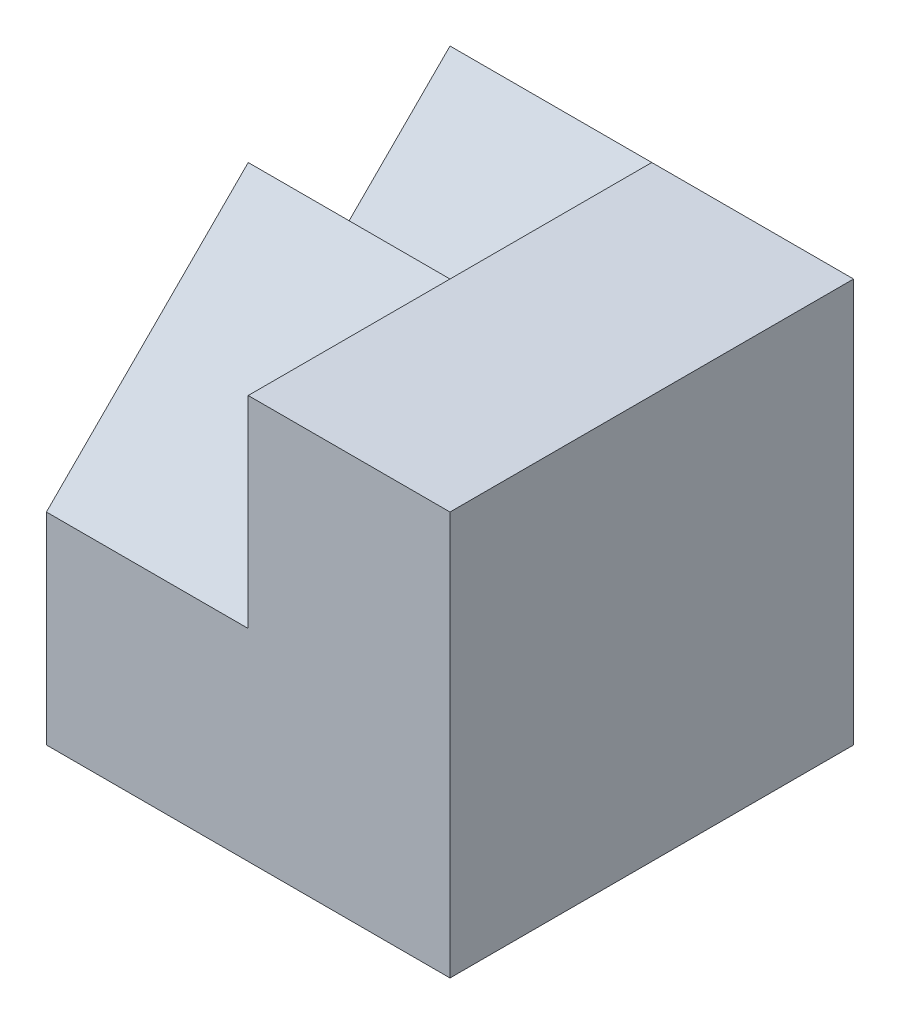
ISO-10303-21;
HEADER;
FILE_DESCRIPTION(('STEP AP214'),'2;1');
FILE_NAME('part.step','',(''),(''),'','','');
FILE_SCHEMA(('AUTOMOTIVE_DESIGN { 1 0 10303 214 1 1 1 1 }'));
ENDSEC;
DATA;
#1=APPLICATION_CONTEXT('core data for automotive mechanical design processes');
#2=APPLICATION_PROTOCOL_DEFINITION('international standard','automotive_design',2000,#1);
#3=PRODUCT_CONTEXT('',#1,'mechanical');
#4=PRODUCT('Part','Part','',(#3));
#5=PRODUCT_RELATED_PRODUCT_CATEGORY('part','',(#4));
#6=PRODUCT_DEFINITION_FORMATION('','',#4);
#7=PRODUCT_DEFINITION_CONTEXT('part definition',#1,'design');
#8=PRODUCT_DEFINITION('design','',#6,#7);
#9=PRODUCT_DEFINITION_SHAPE('','',#8);
#10=(LENGTH_UNIT() NAMED_UNIT(*) SI_UNIT(.MILLI.,.METRE.));
#11=(NAMED_UNIT(*) PLANE_ANGLE_UNIT() SI_UNIT($,.RADIAN.));
#12=(NAMED_UNIT(*) SI_UNIT($,.STERADIAN.) SOLID_ANGLE_UNIT());
#13=UNCERTAINTY_MEASURE_WITH_UNIT(LENGTH_MEASURE(1.E-05),#10,'distance_accuracy_value','');
#14=(GEOMETRIC_REPRESENTATION_CONTEXT(3) GLOBAL_UNCERTAINTY_ASSIGNED_CONTEXT((#13)) GLOBAL_UNIT_ASSIGNED_CONTEXT((#10,
#11,#12)) REPRESENTATION_CONTEXT('',''));
#15=CARTESIAN_POINT('',(0.,0.,0.));
#16=DIRECTION('',(0.,0.,1.));
#17=DIRECTION('',(1.,0.,0.));
#18=AXIS2_PLACEMENT_3D('',#15,#16,#17);
#19=CARTESIAN_POINT('',(-2.,4.,2.));
#20=DIRECTION('',(1.,0.,0.));
#21=DIRECTION('',(0.,0.,-1.));
#22=AXIS2_PLACEMENT_3D('',#19,#20,#21);
#23=PLANE('',#22);
#24=DIRECTION('',(0.,0.707106781186548,-0.707106781186548));
#25=VECTOR('',#24,1.);
#26=CARTESIAN_POINT('',(-2.,2.,2.));
#27=LINE('',#26,#25);
#28=CARTESIAN_POINT('',(-2.,2.,2.));
#29=VERTEX_POINT('',#28);
#30=CARTESIAN_POINT('',(-2.,4.,0.));
#31=VERTEX_POINT('',#30);
#32=EDGE_CURVE('E164',#29,#31,#27,.T.);
#33=ORIENTED_EDGE('',*,*,#32,.T.);
#34=DIRECTION('',(0.,-1.,0.));
#35=VECTOR('',#34,1.);
#36=CARTESIAN_POINT('',(-2.,0.,0.));
#37=LINE('',#36,#35);
#38=CARTESIAN_POINT('',(-2.,2.,0.));
#39=VERTEX_POINT('',#38);
#40=EDGE_CURVE('E177',#31,#39,#37,.T.);
#41=ORIENTED_EDGE('',*,*,#40,.T.);
#42=DIRECTION('',(0.,0.707106781186548,-0.707106781186548));
#43=VECTOR('',#42,1.);
#44=CARTESIAN_POINT('',(-2.,1.,1.));
#45=LINE('',#44,#43);
#46=CARTESIAN_POINT('',(-2.,4.,-2.));
#47=VERTEX_POINT('',#46);
#48=EDGE_CURVE('E134',#39,#47,#45,.T.);
#49=ORIENTED_EDGE('',*,*,#48,.T.);
#50=DIRECTION('',(0.,-1.,0.));
#51=VECTOR('',#50,1.);
#52=CARTESIAN_POINT('',(-2.,4.,-2.));
#53=LINE('',#52,#51);
#54=CARTESIAN_POINT('',(-2.,0.,-2.));
#55=VERTEX_POINT('',#54);
#56=EDGE_CURVE('E60',#47,#55,#53,.T.);
#57=ORIENTED_EDGE('',*,*,#56,.T.);
#58=DIRECTION('',(0.,0.,1.));
#59=VECTOR('',#58,1.);
#60=CARTESIAN_POINT('',(-2.,0.,2.));
#61=LINE('',#60,#59);
#62=CARTESIAN_POINT('',(-2.,0.,2.));
#63=VERTEX_POINT('',#62);
#64=EDGE_CURVE('E107',#55,#63,#61,.T.);
#65=ORIENTED_EDGE('',*,*,#64,.T.);
#66=DIRECTION('',(0.,-1.,0.));
#67=VECTOR('',#66,1.);
#68=CARTESIAN_POINT('',(-2.,4.,2.));
#69=LINE('',#68,#67);
#70=EDGE_CURVE('E101',#29,#63,#69,.T.);
#71=ORIENTED_EDGE('',*,*,#70,.F.);
#72=EDGE_LOOP('',(#33,#41,#49,#57,#65,#71));
#73=FACE_BOUND('',#72,.T.);
#74=ADVANCED_FACE('F52',(#73),#23,.F.);
#75=CARTESIAN_POINT('',(0.,4.,0.));
#76=DIRECTION('',(0.,-1.,0.));
#77=DIRECTION('',(0.,0.,-1.));
#78=AXIS2_PLACEMENT_3D('',#75,#76,#77);
#79=PLANE('',#78);
#80=DIRECTION('',(0.,0.,-1.));
#81=VECTOR('',#80,1.);
#82=CARTESIAN_POINT('',(0.,4.,0.));
#83=LINE('',#82,#81);
#84=CARTESIAN_POINT('',(0.,4.,2.));
#85=VERTEX_POINT('',#84);
#86=CARTESIAN_POINT('',(0.,4.,0.));
#87=VERTEX_POINT('',#86);
#88=EDGE_CURVE('E67',#85,#87,#83,.T.);
#89=ORIENTED_EDGE('',*,*,#88,.F.);
#90=DIRECTION('',(1.,0.,0.));
#91=VECTOR('',#90,1.);
#92=CARTESIAN_POINT('',(-2.,4.,2.));
#93=LINE('',#92,#91);
#94=CARTESIAN_POINT('',(2.,4.,2.));
#95=VERTEX_POINT('',#94);
#96=EDGE_CURVE('E75',#85,#95,#93,.T.);
#97=ORIENTED_EDGE('',*,*,#96,.T.);
#98=DIRECTION('',(0.,0.,-1.));
#99=VECTOR('',#98,1.);
#100=CARTESIAN_POINT('',(2.,4.,2.));
#101=LINE('',#100,#99);
#102=CARTESIAN_POINT('',(2.,4.,-2.));
#103=VERTEX_POINT('',#102);
#104=EDGE_CURVE('E106',#95,#103,#101,.T.);
#105=ORIENTED_EDGE('',*,*,#104,.T.);
#106=DIRECTION('',(-1.,0.,0.));
#107=VECTOR('',#106,1.);
#108=CARTESIAN_POINT('',(-2.,4.,-2.));
#109=LINE('',#108,#107);
#110=CARTESIAN_POINT('',(0.,4.,-2.));
#111=VERTEX_POINT('',#110);
#112=EDGE_CURVE('E187',#103,#111,#109,.T.);
#113=ORIENTED_EDGE('',*,*,#112,.T.);
#114=DIRECTION('',(0.,0.,-1.));
#115=VECTOR('',#114,1.);
#116=CARTESIAN_POINT('',(0.,4.,0.));
#117=LINE('',#116,#115);
#118=EDGE_CURVE('E179',#87,#111,#117,.T.);
#119=ORIENTED_EDGE('',*,*,#118,.F.);
#120=EDGE_LOOP('',(#89,#97,#105,#113,#119));
#121=FACE_BOUND('',#120,.T.);
#122=ADVANCED_FACE('F189',(#121),#79,.F.);
#123=CARTESIAN_POINT('',(-2.,4.,2.));
#124=DIRECTION('',(0.,0.,-1.));
#125=DIRECTION('',(-1.,0.,0.));
#126=AXIS2_PLACEMENT_3D('',#123,#124,#125);
#127=PLANE('',#126);
#128=DIRECTION('',(-1.,0.,0.));
#129=VECTOR('',#128,1.);
#130=CARTESIAN_POINT('',(0.,2.,2.));
#131=LINE('',#130,#129);
#132=CARTESIAN_POINT('',(0.,2.,2.));
#133=VERTEX_POINT('',#132);
#134=EDGE_CURVE('E160',#133,#29,#131,.T.);
#135=ORIENTED_EDGE('',*,*,#134,.T.);
#136=ORIENTED_EDGE('',*,*,#70,.T.);
#137=DIRECTION('',(1.,0.,0.));
#138=VECTOR('',#137,1.);
#139=CARTESIAN_POINT('',(-2.,0.,2.));
#140=LINE('',#139,#138);
#141=CARTESIAN_POINT('',(2.,0.,2.));
#142=VERTEX_POINT('',#141);
#143=EDGE_CURVE('E94',#63,#142,#140,.T.);
#144=ORIENTED_EDGE('',*,*,#143,.T.);
#145=DIRECTION('',(0.,-1.,0.));
#146=VECTOR('',#145,1.);
#147=CARTESIAN_POINT('',(2.,4.,2.));
#148=LINE('',#147,#146);
#149=EDGE_CURVE('E98',#95,#142,#148,.T.);
#150=ORIENTED_EDGE('',*,*,#149,.F.);
#151=ORIENTED_EDGE('',*,*,#96,.F.);
#152=DIRECTION('',(0.,1.,0.));
#153=VECTOR('',#152,1.);
#154=CARTESIAN_POINT('',(0.,0.,2.));
#155=LINE('',#154,#153);
#156=EDGE_CURVE('E168',#133,#85,#155,.T.);
#157=ORIENTED_EDGE('',*,*,#156,.F.);
#158=EDGE_LOOP('',(#135,#136,#144,#150,#151,#157));
#159=FACE_BOUND('',#158,.T.);
#160=ADVANCED_FACE('F97',(#159),#127,.F.);
#161=CARTESIAN_POINT('',(2.,4.,2.));
#162=DIRECTION('',(-1.,0.,0.));
#163=DIRECTION('',(0.,0.,1.));
#164=AXIS2_PLACEMENT_3D('',#161,#162,#163);
#165=PLANE('',#164);
#166=DIRECTION('',(0.,0.,-1.));
#167=VECTOR('',#166,1.);
#168=CARTESIAN_POINT('',(2.,0.,2.));
#169=LINE('',#168,#167);
#170=CARTESIAN_POINT('',(2.,0.,-2.));
#171=VERTEX_POINT('',#170);
#172=EDGE_CURVE('E112',#142,#171,#169,.T.);
#173=ORIENTED_EDGE('',*,*,#172,.T.);
#174=DIRECTION('',(0.,-1.,0.));
#175=VECTOR('',#174,1.);
#176=CARTESIAN_POINT('',(2.,4.,-2.));
#177=LINE('',#176,#175);
#178=EDGE_CURVE('E12',#103,#171,#177,.T.);
#179=ORIENTED_EDGE('',*,*,#178,.F.);
#180=ORIENTED_EDGE('',*,*,#104,.F.);
#181=ORIENTED_EDGE('',*,*,#149,.T.);
#182=EDGE_LOOP('',(#173,#179,#180,#181));
#183=FACE_BOUND('',#182,.T.);
#184=ADVANCED_FACE('F54',(#183),#165,.F.);
#185=CARTESIAN_POINT('',(-2.,4.,-2.));
#186=DIRECTION('',(0.,0.,1.));
#187=DIRECTION('',(1.,0.,0.));
#188=AXIS2_PLACEMENT_3D('',#185,#186,#187);
#189=PLANE('',#188);
#190=DIRECTION('',(-1.,0.,0.));
#191=VECTOR('',#190,1.);
#192=CARTESIAN_POINT('',(-2.,0.,-2.));
#193=LINE('',#192,#191);
#194=EDGE_CURVE('E115',#171,#55,#193,.T.);
#195=ORIENTED_EDGE('',*,*,#194,.T.);
#196=ORIENTED_EDGE('',*,*,#56,.F.);
#197=DIRECTION('',(-1.,0.,0.));
#198=VECTOR('',#197,1.);
#199=CARTESIAN_POINT('',(0.,4.,-2.));
#200=LINE('',#199,#198);
#201=EDGE_CURVE('E116',#111,#47,#200,.T.);
#202=ORIENTED_EDGE('',*,*,#201,.F.);
#203=ORIENTED_EDGE('',*,*,#112,.F.);
#204=ORIENTED_EDGE('',*,*,#178,.T.);
#205=EDGE_LOOP('',(#195,#196,#202,#203,#204));
#206=FACE_BOUND('',#205,.T.);
#207=ADVANCED_FACE('F137',(#206),#189,.F.);
#208=CARTESIAN_POINT('',(0.,0.,0.));
#209=DIRECTION('',(0.,-1.,0.));
#210=DIRECTION('',(0.,0.,-1.));
#211=AXIS2_PLACEMENT_3D('',#208,#209,#210);
#212=PLANE('',#211);
#213=ORIENTED_EDGE('',*,*,#172,.F.);
#214=ORIENTED_EDGE('',*,*,#143,.F.);
#215=ORIENTED_EDGE('',*,*,#64,.F.);
#216=ORIENTED_EDGE('',*,*,#194,.F.);
#217=EDGE_LOOP('',(#213,#214,#215,#216));
#218=FACE_BOUND('',#217,.T.);
#219=ADVANCED_FACE('F114',(#218),#212,.T.);
#220=CARTESIAN_POINT('',(0.,1.,1.));
#221=DIRECTION('',(0.,0.707106781186547,0.707106781186547));
#222=DIRECTION('',(0.,-0.707106781186548,0.707106781186548));
#223=AXIS2_PLACEMENT_3D('',#220,#221,#222);
#224=PLANE('',#223);
#225=ORIENTED_EDGE('',*,*,#48,.F.);
#226=DIRECTION('',(-1.,0.,0.));
#227=VECTOR('',#226,1.);
#228=CARTESIAN_POINT('',(0.,2.,0.));
#229=LINE('',#228,#227);
#230=CARTESIAN_POINT('',(0.,2.,0.));
#231=VERTEX_POINT('',#230);
#232=EDGE_CURVE('E182',#231,#39,#229,.T.);
#233=ORIENTED_EDGE('',*,*,#232,.F.);
#234=DIRECTION('',(0.,0.707106781186548,-0.707106781186548));
#235=VECTOR('',#234,1.);
#236=CARTESIAN_POINT('',(0.,1.,1.));
#237=LINE('',#236,#235);
#238=EDGE_CURVE('E174',#231,#111,#237,.T.);
#239=ORIENTED_EDGE('',*,*,#238,.T.);
#240=ORIENTED_EDGE('',*,*,#201,.T.);
#241=EDGE_LOOP('',(#225,#233,#239,#240));
#242=FACE_BOUND('',#241,.T.);
#243=ADVANCED_FACE('F198',(#242),#224,.T.);
#244=CARTESIAN_POINT('',(0.,0.,0.));
#245=DIRECTION('',(0.,0.,-1.));
#246=DIRECTION('',(-1.,0.,0.));
#247=AXIS2_PLACEMENT_3D('',#244,#245,#246);
#248=PLANE('',#247);
#249=ORIENTED_EDGE('',*,*,#40,.F.);
#250=DIRECTION('',(-1.,0.,0.));
#251=VECTOR('',#250,1.);
#252=CARTESIAN_POINT('',(0.,4.,0.));
#253=LINE('',#252,#251);
#254=EDGE_CURVE('E120',#87,#31,#253,.T.);
#255=ORIENTED_EDGE('',*,*,#254,.F.);
#256=DIRECTION('',(0.,-1.,0.));
#257=VECTOR('',#256,1.);
#258=CARTESIAN_POINT('',(0.,0.,0.));
#259=LINE('',#258,#257);
#260=EDGE_CURVE('E176',#87,#231,#259,.T.);
#261=ORIENTED_EDGE('',*,*,#260,.T.);
#262=ORIENTED_EDGE('',*,*,#232,.T.);
#263=EDGE_LOOP('',(#249,#255,#261,#262));
#264=FACE_BOUND('',#263,.T.);
#265=ADVANCED_FACE('F197',(#264),#248,.T.);
#266=CARTESIAN_POINT('',(0.,0.,0.));
#267=DIRECTION('',(-1.,0.,0.));
#268=DIRECTION('',(0.,0.,1.));
#269=AXIS2_PLACEMENT_3D('',#266,#267,#268);
#270=PLANE('',#269);
#271=ORIENTED_EDGE('',*,*,#238,.F.);
#272=ORIENTED_EDGE('',*,*,#260,.F.);
#273=ORIENTED_EDGE('',*,*,#118,.T.);
#274=EDGE_LOOP('',(#271,#272,#273));
#275=FACE_BOUND('',#274,.T.);
#276=ADVANCED_FACE('F192',(#275),#270,.T.);
#277=CARTESIAN_POINT('',(0.,2.,2.));
#278=DIRECTION('',(0.,0.707106781186547,0.707106781186547));
#279=DIRECTION('',(0.,-0.707106781186548,0.707106781186548));
#280=AXIS2_PLACEMENT_3D('',#277,#278,#279);
#281=PLANE('',#280);
#282=ORIENTED_EDGE('',*,*,#32,.F.);
#283=ORIENTED_EDGE('',*,*,#134,.F.);
#284=DIRECTION('',(0.,0.707106781186548,-0.707106781186548));
#285=VECTOR('',#284,1.);
#286=CARTESIAN_POINT('',(0.,2.,2.));
#287=LINE('',#286,#285);
#288=EDGE_CURVE('E162',#133,#87,#287,.T.);
#289=ORIENTED_EDGE('',*,*,#288,.T.);
#290=ORIENTED_EDGE('',*,*,#254,.T.);
#291=EDGE_LOOP('',(#282,#283,#289,#290));
#292=FACE_BOUND('',#291,.T.);
#293=ADVANCED_FACE('F161',(#292),#281,.T.);
#294=CARTESIAN_POINT('',(0.,0.,0.));
#295=DIRECTION('',(-1.,0.,0.));
#296=DIRECTION('',(0.,0.,1.));
#297=AXIS2_PLACEMENT_3D('',#294,#295,#296);
#298=PLANE('',#297);
#299=ORIENTED_EDGE('',*,*,#288,.F.);
#300=ORIENTED_EDGE('',*,*,#156,.T.);
#301=ORIENTED_EDGE('',*,*,#88,.T.);
#302=EDGE_LOOP('',(#299,#300,#301));
#303=FACE_BOUND('',#302,.T.);
#304=ADVANCED_FACE('F167',(#303),#298,.T.);
#305=CLOSED_SHELL('',(#74,#122,#160,#184,#207,#219,#243,#265,#276,#293,#304));
#306=MANIFOLD_SOLID_BREP('B2',#305);
#307=ADVANCED_BREP_SHAPE_REPRESENTATION('',(#18,#306),#14);
#308=SHAPE_DEFINITION_REPRESENTATION(#9,#307);
ENDSEC;
END-ISO-10303-21;
